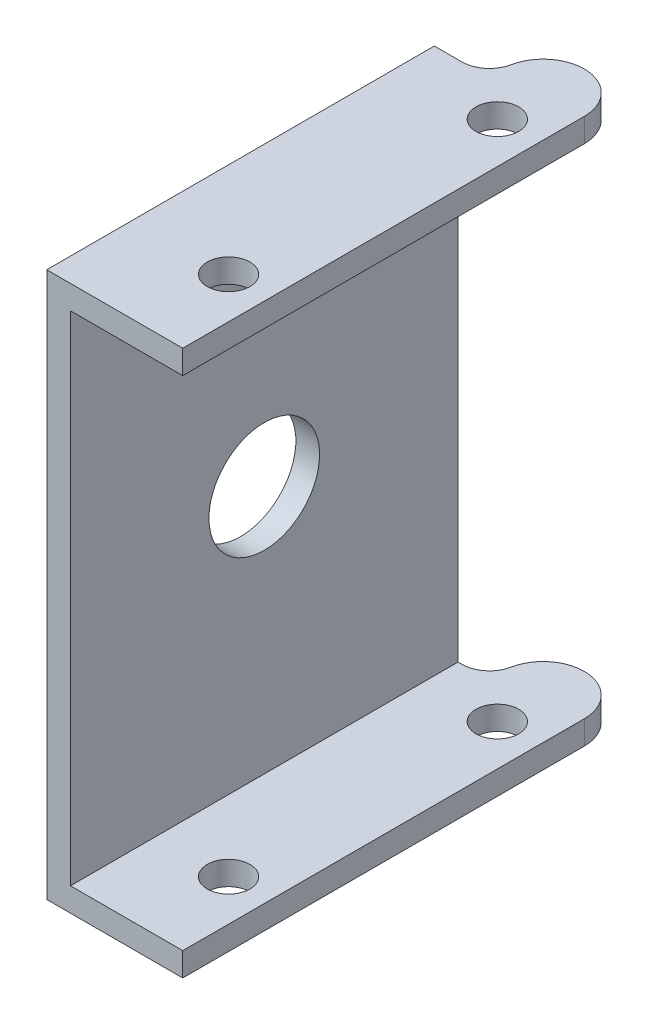
ISO-10303-21;
HEADER;
FILE_DESCRIPTION(('STEP AP214'),'2;1');
FILE_NAME('part.step','',(''),(''),'','','');
FILE_SCHEMA(('AUTOMOTIVE_DESIGN { 1 0 10303 214 1 1 1 1 }'));
ENDSEC;
DATA;
#1=APPLICATION_CONTEXT('core data for automotive mechanical design processes');
#2=APPLICATION_PROTOCOL_DEFINITION('international standard','automotive_design',2000,#1);
#3=PRODUCT_CONTEXT('',#1,'mechanical');
#4=PRODUCT('Part','Part','',(#3));
#5=PRODUCT_RELATED_PRODUCT_CATEGORY('part','',(#4));
#6=PRODUCT_DEFINITION_FORMATION('','',#4);
#7=PRODUCT_DEFINITION_CONTEXT('part definition',#1,'design');
#8=PRODUCT_DEFINITION('design','',#6,#7);
#9=PRODUCT_DEFINITION_SHAPE('','',#8);
#10=(LENGTH_UNIT() NAMED_UNIT(*) SI_UNIT(.MILLI.,.METRE.));
#11=(NAMED_UNIT(*) PLANE_ANGLE_UNIT() SI_UNIT($,.RADIAN.));
#12=(NAMED_UNIT(*) SI_UNIT($,.STERADIAN.) SOLID_ANGLE_UNIT());
#13=UNCERTAINTY_MEASURE_WITH_UNIT(LENGTH_MEASURE(1.E-05),#10,'distance_accuracy_value','');
#14=(GEOMETRIC_REPRESENTATION_CONTEXT(3) GLOBAL_UNCERTAINTY_ASSIGNED_CONTEXT((#13)) GLOBAL_UNIT_ASSIGNED_CONTEXT((#10,
#11,#12)) REPRESENTATION_CONTEXT('',''));
#15=CARTESIAN_POINT('',(0.,0.,0.));
#16=DIRECTION('',(0.,0.,1.));
#17=DIRECTION('',(1.,0.,0.));
#18=AXIS2_PLACEMENT_3D('',#15,#16,#17);
#19=CARTESIAN_POINT('',(8.6,0.,14.));
#20=DIRECTION('',(0.,1.,0.));
#21=DIRECTION('',(-1.,0.,0.));
#22=AXIS2_PLACEMENT_3D('',#19,#20,#21);
#23=PLANE('',#22);
#24=CARTESIAN_POINT('',(6.,0.,8.5));
#25=DIRECTION('',(0.,1.,0.));
#26=DIRECTION('',(-1.,0.,0.));
#27=AXIS2_PLACEMENT_3D('',#24,#25,#26);
#28=CIRCLE('',#27,1.35);
#29=CARTESIAN_POINT('',(4.65,0.,8.5));
#30=VERTEX_POINT('',#29);
#31=EDGE_CURVE('E162',#30,#30,#28,.T.);
#32=ORIENTED_EDGE('',*,*,#31,.T.);
#33=EDGE_LOOP('',(#32));
#34=FACE_BOUND('',#33,.T.);
#35=CARTESIAN_POINT('',(6.,0.,-8.5));
#36=DIRECTION('',(0.,1.,0.));
#37=DIRECTION('',(-1.,0.,0.));
#38=AXIS2_PLACEMENT_3D('',#35,#36,#37);
#39=CIRCLE('',#38,1.35);
#40=CARTESIAN_POINT('',(4.65,0.,-8.5));
#41=VERTEX_POINT('',#40);
#42=EDGE_CURVE('E174',#41,#41,#39,.T.);
#43=ORIENTED_EDGE('',*,*,#42,.T.);
#44=EDGE_LOOP('',(#43));
#45=FACE_BOUND('',#44,.T.);
#46=CARTESIAN_POINT('',(6.,0.,-11.4));
#47=DIRECTION('',(0.,1.,0.));
#48=DIRECTION('',(0.,0.,1.));
#49=AXIS2_PLACEMENT_3D('',#46,#47,#48);
#50=CIRCLE('',#49,2.6);
#51=CARTESIAN_POINT('',(8.6,0.,-11.4));
#52=VERTEX_POINT('',#51);
#53=CARTESIAN_POINT('',(3.4511622832782,0.,-11.9132507124364));
#54=VERTEX_POINT('',#53);
#55=EDGE_CURVE('E121',#52,#54,#50,.T.);
#56=ORIENTED_EDGE('',*,*,#55,.F.);
#57=DIRECTION('',(0.,0.,-1.));
#58=VECTOR('',#57,1.);
#59=CARTESIAN_POINT('',(8.6,0.,14.));
#60=LINE('',#59,#58);
#61=CARTESIAN_POINT('',(8.6,0.,14.));
#62=VERTEX_POINT('',#61);
#63=EDGE_CURVE('E11',#62,#52,#60,.T.);
#64=ORIENTED_EDGE('',*,*,#63,.F.);
#65=DIRECTION('',(1.,0.,0.));
#66=VECTOR('',#65,1.);
#67=CARTESIAN_POINT('',(8.6,0.,14.));
#68=LINE('',#67,#66);
#69=CARTESIAN_POINT('',(0.,0.,14.));
#70=VERTEX_POINT('',#69);
#71=EDGE_CURVE('E185',#70,#62,#68,.T.);
#72=ORIENTED_EDGE('',*,*,#71,.F.);
#73=DIRECTION('',(0.,0.,-1.));
#74=VECTOR('',#73,1.);
#75=CARTESIAN_POINT('',(0.,0.,14.));
#76=LINE('',#75,#74);
#77=CARTESIAN_POINT('',(0.,0.,-10.514544668059));
#78=VERTEX_POINT('',#77);
#79=EDGE_CURVE('E125',#70,#78,#76,.T.);
#80=ORIENTED_EDGE('',*,*,#79,.T.);
#81=DIRECTION('',(-1.,0.,0.));
#82=VECTOR('',#81,1.);
#83=CARTESIAN_POINT('',(0.,0.,-10.514544668059));
#84=LINE('',#83,#82);
#85=CARTESIAN_POINT('',(1.74272766597048,0.,-10.514544668059));
#86=VERTEX_POINT('',#85);
#87=EDGE_CURVE('E30',#86,#78,#84,.T.);
#88=ORIENTED_EDGE('',*,*,#87,.F.);
#89=CARTESIAN_POINT('',(1.74272766597048,0.,-12.2572723340295));
#90=DIRECTION('',(0.,1.,0.));
#91=DIRECTION('',(0.,0.,1.));
#92=AXIS2_PLACEMENT_3D('',#89,#90,#91);
#93=CIRCLE('',#92,1.74272766597049);
#94=EDGE_CURVE('E115',#86,#54,#93,.T.);
#95=ORIENTED_EDGE('',*,*,#94,.T.);
#96=EDGE_LOOP('',(#56,#64,#72,#80,#88,#95));
#97=FACE_BOUND('',#96,.T.);
#98=ADVANCED_FACE('F16',(#34,#45,#97),#23,.F.);
#99=CARTESIAN_POINT('',(1.5,1.5,14.));
#100=DIRECTION('',(0.,-1.,0.));
#101=DIRECTION('',(0.,0.,-1.));
#102=AXIS2_PLACEMENT_3D('',#99,#100,#101);
#103=PLANE('',#102);
#104=CARTESIAN_POINT('',(6.,1.5,8.5));
#105=DIRECTION('',(0.,-1.,0.));
#106=DIRECTION('',(0.,0.,-1.));
#107=AXIS2_PLACEMENT_3D('',#104,#105,#106);
#108=CIRCLE('',#107,1.35);
#109=CARTESIAN_POINT('',(6.,1.5,7.15));
#110=VERTEX_POINT('',#109);
#111=EDGE_CURVE('E170',#110,#110,#108,.T.);
#112=ORIENTED_EDGE('',*,*,#111,.T.);
#113=EDGE_LOOP('',(#112));
#114=FACE_BOUND('',#113,.T.);
#115=CARTESIAN_POINT('',(6.,1.5,-8.5));
#116=DIRECTION('',(0.,-1.,0.));
#117=DIRECTION('',(0.,0.,-1.));
#118=AXIS2_PLACEMENT_3D('',#115,#116,#117);
#119=CIRCLE('',#118,1.35);
#120=CARTESIAN_POINT('',(6.,1.5,-9.85));
#121=VERTEX_POINT('',#120);
#122=EDGE_CURVE('E182',#121,#121,#119,.T.);
#123=ORIENTED_EDGE('',*,*,#122,.T.);
#124=EDGE_LOOP('',(#123));
#125=FACE_BOUND('',#124,.T.);
#126=DIRECTION('',(0.,0.,-1.));
#127=VECTOR('',#126,1.);
#128=CARTESIAN_POINT('',(8.6,1.5,14.));
#129=LINE('',#128,#127);
#130=CARTESIAN_POINT('',(8.6,1.5,14.));
#131=VERTEX_POINT('',#130);
#132=CARTESIAN_POINT('',(8.6,1.5,-11.4));
#133=VERTEX_POINT('',#132);
#134=EDGE_CURVE('E23',#131,#133,#129,.T.);
#135=ORIENTED_EDGE('',*,*,#134,.T.);
#136=CARTESIAN_POINT('',(6.,1.5,-11.4));
#137=DIRECTION('',(0.,-1.,0.));
#138=DIRECTION('',(0.,0.,-1.));
#139=AXIS2_PLACEMENT_3D('',#136,#137,#138);
#140=CIRCLE('',#139,2.6);
#141=CARTESIAN_POINT('',(3.4511622832782,1.5,-11.9132507124364));
#142=VERTEX_POINT('',#141);
#143=EDGE_CURVE('E144',#142,#133,#140,.T.);
#144=ORIENTED_EDGE('',*,*,#143,.F.);
#145=CARTESIAN_POINT('',(1.74272766597048,1.5,-12.2572723340295));
#146=DIRECTION('',(0.,-1.,0.));
#147=DIRECTION('',(0.,0.,-1.));
#148=AXIS2_PLACEMENT_3D('',#145,#146,#147);
#149=CIRCLE('',#148,1.74272766597049);
#150=CARTESIAN_POINT('',(1.74272766597048,1.5,-10.514544668059));
#151=VERTEX_POINT('',#150);
#152=EDGE_CURVE('E159',#142,#151,#149,.T.);
#153=ORIENTED_EDGE('',*,*,#152,.T.);
#154=DIRECTION('',(1.,0.,0.));
#155=VECTOR('',#154,1.);
#156=CARTESIAN_POINT('',(1.5,1.5,-10.514544668059));
#157=LINE('',#156,#155);
#158=CARTESIAN_POINT('',(1.5,1.5,-10.514544668059));
#159=VERTEX_POINT('',#158);
#160=EDGE_CURVE('E107',#159,#151,#157,.T.);
#161=ORIENTED_EDGE('',*,*,#160,.F.);
#162=DIRECTION('',(0.,0.,-1.));
#163=VECTOR('',#162,1.);
#164=CARTESIAN_POINT('',(1.5,1.5,14.));
#165=LINE('',#164,#163);
#166=CARTESIAN_POINT('',(1.5,1.5,14.));
#167=VERTEX_POINT('',#166);
#168=EDGE_CURVE('E213',#167,#159,#165,.T.);
#169=ORIENTED_EDGE('',*,*,#168,.F.);
#170=DIRECTION('',(-1.,0.,0.));
#171=VECTOR('',#170,1.);
#172=CARTESIAN_POINT('',(1.5,1.5,14.));
#173=LINE('',#172,#171);
#174=EDGE_CURVE('E189',#131,#167,#173,.T.);
#175=ORIENTED_EDGE('',*,*,#174,.F.);
#176=EDGE_LOOP('',(#135,#144,#153,#161,#169,#175));
#177=FACE_BOUND('',#176,.T.);
#178=ADVANCED_FACE('F220',(#114,#125,#177),#103,.F.);
#179=CARTESIAN_POINT('',(1.5,33.,14.));
#180=DIRECTION('',(-1.,0.,0.));
#181=DIRECTION('',(0.,-1.,0.));
#182=AXIS2_PLACEMENT_3D('',#179,#180,#181);
#183=PLANE('',#182);
#184=CARTESIAN_POINT('',(1.5,17.25,1.74272766597048));
#185=DIRECTION('',(-1.,0.,0.));
#186=DIRECTION('',(0.,-1.,0.));
#187=AXIS2_PLACEMENT_3D('',#184,#185,#186);
#188=CIRCLE('',#187,3.5);
#189=CARTESIAN_POINT('',(1.5,13.75,1.74272766597048));
#190=VERTEX_POINT('',#189);
#191=EDGE_CURVE('E131',#190,#190,#188,.T.);
#192=ORIENTED_EDGE('',*,*,#191,.T.);
#193=EDGE_LOOP('',(#192));
#194=FACE_BOUND('',#193,.T.);
#195=DIRECTION('',(0.,-1.,0.));
#196=VECTOR('',#195,1.);
#197=CARTESIAN_POINT('',(1.5,33.,-10.514544668059));
#198=LINE('',#197,#196);
#199=CARTESIAN_POINT('',(1.5,33.,-10.514544668059));
#200=VERTEX_POINT('',#199);
#201=EDGE_CURVE('E153',#200,#159,#198,.T.);
#202=ORIENTED_EDGE('',*,*,#201,.F.);
#203=DIRECTION('',(0.,0.,-1.));
#204=VECTOR('',#203,1.);
#205=CARTESIAN_POINT('',(1.5,33.,14.));
#206=LINE('',#205,#204);
#207=CARTESIAN_POINT('',(1.5,33.,14.));
#208=VERTEX_POINT('',#207);
#209=EDGE_CURVE('E210',#208,#200,#206,.T.);
#210=ORIENTED_EDGE('',*,*,#209,.F.);
#211=DIRECTION('',(0.,1.,0.));
#212=VECTOR('',#211,1.);
#213=CARTESIAN_POINT('',(1.5,33.,14.));
#214=LINE('',#213,#212);
#215=EDGE_CURVE('E191',#167,#208,#214,.T.);
#216=ORIENTED_EDGE('',*,*,#215,.F.);
#217=ORIENTED_EDGE('',*,*,#168,.T.);
#218=EDGE_LOOP('',(#202,#210,#216,#217));
#219=FACE_BOUND('',#218,.T.);
#220=ADVANCED_FACE('F232',(#194,#219),#183,.F.);
#221=CARTESIAN_POINT('',(8.6,33.,14.));
#222=DIRECTION('',(0.,1.,0.));
#223=DIRECTION('',(0.,0.,1.));
#224=AXIS2_PLACEMENT_3D('',#221,#222,#223);
#225=PLANE('',#224);
#226=CARTESIAN_POINT('',(6.,33.,8.5));
#227=DIRECTION('',(0.,1.,0.));
#228=DIRECTION('',(0.,0.,1.));
#229=AXIS2_PLACEMENT_3D('',#226,#227,#228);
#230=CIRCLE('',#229,1.35);
#231=CARTESIAN_POINT('',(6.,33.,9.85));
#232=VERTEX_POINT('',#231);
#233=EDGE_CURVE('E165',#232,#232,#230,.T.);
#234=ORIENTED_EDGE('',*,*,#233,.T.);
#235=EDGE_LOOP('',(#234));
#236=FACE_BOUND('',#235,.T.);
#237=CARTESIAN_POINT('',(6.,33.,-8.5));
#238=DIRECTION('',(0.,1.,0.));
#239=DIRECTION('',(0.,0.,1.));
#240=AXIS2_PLACEMENT_3D('',#237,#238,#239);
#241=CIRCLE('',#240,1.35);
#242=CARTESIAN_POINT('',(6.,33.,-7.15));
#243=VERTEX_POINT('',#242);
#244=EDGE_CURVE('E177',#243,#243,#241,.T.);
#245=ORIENTED_EDGE('',*,*,#244,.T.);
#246=EDGE_LOOP('',(#245));
#247=FACE_BOUND('',#246,.T.);
#248=CARTESIAN_POINT('',(6.,33.,-11.4));
#249=DIRECTION('',(0.,1.,0.));
#250=DIRECTION('',(0.,0.,1.));
#251=AXIS2_PLACEMENT_3D('',#248,#249,#250);
#252=CIRCLE('',#251,2.6);
#253=CARTESIAN_POINT('',(8.6,33.,-11.4));
#254=VERTEX_POINT('',#253);
#255=CARTESIAN_POINT('',(3.4511622832782,33.,-11.9132507124364));
#256=VERTEX_POINT('',#255);
#257=EDGE_CURVE('E148',#254,#256,#252,.T.);
#258=ORIENTED_EDGE('',*,*,#257,.F.);
#259=DIRECTION('',(0.,0.,-1.));
#260=VECTOR('',#259,1.);
#261=CARTESIAN_POINT('',(8.6,33.,14.));
#262=LINE('',#261,#260);
#263=CARTESIAN_POINT('',(8.6,33.,14.));
#264=VERTEX_POINT('',#263);
#265=EDGE_CURVE('E207',#264,#254,#262,.T.);
#266=ORIENTED_EDGE('',*,*,#265,.F.);
#267=DIRECTION('',(1.,0.,0.));
#268=VECTOR('',#267,1.);
#269=CARTESIAN_POINT('',(8.6,33.,14.));
#270=LINE('',#269,#268);
#271=EDGE_CURVE('E193',#208,#264,#270,.T.);
#272=ORIENTED_EDGE('',*,*,#271,.F.);
#273=ORIENTED_EDGE('',*,*,#209,.T.);
#274=DIRECTION('',(-1.,0.,0.));
#275=VECTOR('',#274,1.);
#276=CARTESIAN_POINT('',(8.6,33.,-10.514544668059));
#277=LINE('',#276,#275);
#278=CARTESIAN_POINT('',(1.74272766597048,33.,-10.514544668059));
#279=VERTEX_POINT('',#278);
#280=EDGE_CURVE('E150',#279,#200,#277,.T.);
#281=ORIENTED_EDGE('',*,*,#280,.F.);
#282=CARTESIAN_POINT('',(1.74272766597048,33.,-12.2572723340295));
#283=DIRECTION('',(0.,1.,0.));
#284=DIRECTION('',(0.,0.,1.));
#285=AXIS2_PLACEMENT_3D('',#282,#283,#284);
#286=CIRCLE('',#285,1.74272766597049);
#287=EDGE_CURVE('E156',#279,#256,#286,.T.);
#288=ORIENTED_EDGE('',*,*,#287,.T.);
#289=EDGE_LOOP('',(#258,#266,#272,#273,#281,#288));
#290=FACE_BOUND('',#289,.T.);
#291=ADVANCED_FACE('F238',(#236,#247,#290),#225,.F.);
#292=CARTESIAN_POINT('',(0.,34.5,14.));
#293=DIRECTION('',(0.,-1.,0.));
#294=DIRECTION('',(0.,0.,-1.));
#295=AXIS2_PLACEMENT_3D('',#292,#293,#294);
#296=PLANE('',#295);
#297=CARTESIAN_POINT('',(6.,34.5,8.5));
#298=DIRECTION('',(0.,1.,0.));
#299=DIRECTION('',(-1.,0.,0.));
#300=AXIS2_PLACEMENT_3D('',#297,#298,#299);
#301=CIRCLE('',#300,1.35);
#302=CARTESIAN_POINT('',(4.65,34.5,8.5));
#303=VERTEX_POINT('',#302);
#304=EDGE_CURVE('E161',#303,#303,#301,.T.);
#305=ORIENTED_EDGE('',*,*,#304,.F.);
#306=EDGE_LOOP('',(#305));
#307=FACE_BOUND('',#306,.T.);
#308=CARTESIAN_POINT('',(6.,34.5,-8.5));
#309=DIRECTION('',(0.,1.,0.));
#310=DIRECTION('',(-1.,0.,0.));
#311=AXIS2_PLACEMENT_3D('',#308,#309,#310);
#312=CIRCLE('',#311,1.35);
#313=CARTESIAN_POINT('',(4.65,34.5,-8.5));
#314=VERTEX_POINT('',#313);
#315=EDGE_CURVE('E173',#314,#314,#312,.T.);
#316=ORIENTED_EDGE('',*,*,#315,.F.);
#317=EDGE_LOOP('',(#316));
#318=FACE_BOUND('',#317,.T.);
#319=CARTESIAN_POINT('',(6.,34.5,-11.4));
#320=DIRECTION('',(0.,1.,0.));
#321=DIRECTION('',(0.,0.,1.));
#322=AXIS2_PLACEMENT_3D('',#319,#320,#321);
#323=CIRCLE('',#322,2.6);
#324=CARTESIAN_POINT('',(8.6,34.5,-11.4));
#325=VERTEX_POINT('',#324);
#326=CARTESIAN_POINT('',(3.4511622832782,34.5,-11.9132507124364));
#327=VERTEX_POINT('',#326);
#328=EDGE_CURVE('E126',#325,#327,#323,.T.);
#329=ORIENTED_EDGE('',*,*,#328,.T.);
#330=CARTESIAN_POINT('',(1.74272766597048,34.5,-12.2572723340295));
#331=DIRECTION('',(0.,1.,0.));
#332=DIRECTION('',(0.,0.,1.));
#333=AXIS2_PLACEMENT_3D('',#330,#331,#332);
#334=CIRCLE('',#333,1.74272766597049);
#335=CARTESIAN_POINT('',(1.74272766597048,34.5,-10.514544668059));
#336=VERTEX_POINT('',#335);
#337=EDGE_CURVE('E128',#336,#327,#334,.T.);
#338=ORIENTED_EDGE('',*,*,#337,.F.);
#339=DIRECTION('',(-1.,0.,0.));
#340=VECTOR('',#339,1.);
#341=CARTESIAN_POINT('',(0.,34.5,-10.514544668059));
#342=LINE('',#341,#340);
#343=CARTESIAN_POINT('',(0.,34.5,-10.514544668059));
#344=VERTEX_POINT('',#343);
#345=EDGE_CURVE('E136',#336,#344,#342,.T.);
#346=ORIENTED_EDGE('',*,*,#345,.T.);
#347=DIRECTION('',(0.,0.,-1.));
#348=VECTOR('',#347,1.);
#349=CARTESIAN_POINT('',(0.,34.5,14.));
#350=LINE('',#349,#348);
#351=CARTESIAN_POINT('',(0.,34.5,14.));
#352=VERTEX_POINT('',#351);
#353=EDGE_CURVE('E201',#352,#344,#350,.T.);
#354=ORIENTED_EDGE('',*,*,#353,.F.);
#355=DIRECTION('',(-1.,0.,0.));
#356=VECTOR('',#355,1.);
#357=CARTESIAN_POINT('',(0.,34.5,14.));
#358=LINE('',#357,#356);
#359=CARTESIAN_POINT('',(8.6,34.5,14.));
#360=VERTEX_POINT('',#359);
#361=EDGE_CURVE('E197',#360,#352,#358,.T.);
#362=ORIENTED_EDGE('',*,*,#361,.F.);
#363=DIRECTION('',(0.,0.,-1.));
#364=VECTOR('',#363,1.);
#365=CARTESIAN_POINT('',(8.6,34.5,14.));
#366=LINE('',#365,#364);
#367=EDGE_CURVE('E204',#360,#325,#366,.T.);
#368=ORIENTED_EDGE('',*,*,#367,.T.);
#369=EDGE_LOOP('',(#329,#338,#346,#354,#362,#368));
#370=FACE_BOUND('',#369,.T.);
#371=ADVANCED_FACE('F247',(#307,#318,#370),#296,.F.);
#372=CARTESIAN_POINT('',(0.,0.,14.));
#373=DIRECTION('',(1.,0.,0.));
#374=DIRECTION('',(0.,0.,-1.));
#375=AXIS2_PLACEMENT_3D('',#372,#373,#374);
#376=PLANE('',#375);
#377=CARTESIAN_POINT('',(0.,17.25,1.74272766597048));
#378=DIRECTION('',(-1.,0.,0.));
#379=DIRECTION('',(0.,0.,1.));
#380=AXIS2_PLACEMENT_3D('',#377,#378,#379);
#381=CIRCLE('',#380,3.5);
#382=CARTESIAN_POINT('',(0.,17.25,5.24272766597048));
#383=VERTEX_POINT('',#382);
#384=EDGE_CURVE('E440',#383,#383,#381,.T.);
#385=ORIENTED_EDGE('',*,*,#384,.F.);
#386=EDGE_LOOP('',(#385));
#387=FACE_BOUND('',#386,.T.);
#388=DIRECTION('',(0.,1.,0.));
#389=VECTOR('',#388,1.);
#390=CARTESIAN_POINT('',(0.,0.,-10.514544668059));
#391=LINE('',#390,#389);
#392=EDGE_CURVE('E135',#78,#344,#391,.T.);
#393=ORIENTED_EDGE('',*,*,#392,.F.);
#394=ORIENTED_EDGE('',*,*,#79,.F.);
#395=DIRECTION('',(0.,-1.,0.));
#396=VECTOR('',#395,1.);
#397=CARTESIAN_POINT('',(0.,0.,14.));
#398=LINE('',#397,#396);
#399=EDGE_CURVE('E38',#352,#70,#398,.T.);
#400=ORIENTED_EDGE('',*,*,#399,.F.);
#401=ORIENTED_EDGE('',*,*,#353,.T.);
#402=EDGE_LOOP('',(#393,#394,#400,#401));
#403=FACE_BOUND('',#402,.T.);
#404=ADVANCED_FACE('F251',(#387,#403),#376,.F.);
#405=CARTESIAN_POINT('',(8.6,1.5,14.));
#406=DIRECTION('',(-1.,0.,0.));
#407=DIRECTION('',(0.,0.,1.));
#408=AXIS2_PLACEMENT_3D('',#405,#406,#407);
#409=PLANE('',#408);
#410=ORIENTED_EDGE('',*,*,#63,.T.);
#411=DIRECTION('',(0.,1.,0.));
#412=VECTOR('',#411,1.);
#413=CARTESIAN_POINT('',(8.6,0.,-11.4));
#414=LINE('',#413,#412);
#415=EDGE_CURVE('E141',#52,#133,#414,.T.);
#416=ORIENTED_EDGE('',*,*,#415,.T.);
#417=ORIENTED_EDGE('',*,*,#134,.F.);
#418=DIRECTION('',(0.,1.,0.));
#419=VECTOR('',#418,1.);
#420=CARTESIAN_POINT('',(8.6,1.5,14.));
#421=LINE('',#420,#419);
#422=EDGE_CURVE('E187',#62,#131,#421,.T.);
#423=ORIENTED_EDGE('',*,*,#422,.F.);
#424=EDGE_LOOP('',(#410,#416,#417,#423));
#425=FACE_BOUND('',#424,.T.);
#426=ADVANCED_FACE('F223',(#425),#409,.F.);
#427=CARTESIAN_POINT('',(8.6,34.5,14.));
#428=DIRECTION('',(-1.,0.,0.));
#429=DIRECTION('',(0.,-1.,0.));
#430=AXIS2_PLACEMENT_3D('',#427,#428,#429);
#431=PLANE('',#430);
#432=ORIENTED_EDGE('',*,*,#265,.T.);
#433=EDGE_CURVE('E145',#254,#325,#414,.T.);
#434=ORIENTED_EDGE('',*,*,#433,.T.);
#435=ORIENTED_EDGE('',*,*,#367,.F.);
#436=DIRECTION('',(0.,1.,0.));
#437=VECTOR('',#436,1.);
#438=CARTESIAN_POINT('',(8.6,34.5,14.));
#439=LINE('',#438,#437);
#440=EDGE_CURVE('E195',#264,#360,#439,.T.);
#441=ORIENTED_EDGE('',*,*,#440,.F.);
#442=EDGE_LOOP('',(#432,#434,#435,#441));
#443=FACE_BOUND('',#442,.T.);
#444=ADVANCED_FACE('F245',(#443),#431,.F.);
#445=CARTESIAN_POINT('',(0.,0.,14.));
#446=DIRECTION('',(0.,0.,-1.));
#447=DIRECTION('',(-1.,0.,0.));
#448=AXIS2_PLACEMENT_3D('',#445,#446,#447);
#449=PLANE('',#448);
#450=ORIENTED_EDGE('',*,*,#71,.T.);
#451=ORIENTED_EDGE('',*,*,#422,.T.);
#452=ORIENTED_EDGE('',*,*,#174,.T.);
#453=ORIENTED_EDGE('',*,*,#215,.T.);
#454=ORIENTED_EDGE('',*,*,#271,.T.);
#455=ORIENTED_EDGE('',*,*,#440,.T.);
#456=ORIENTED_EDGE('',*,*,#361,.T.);
#457=ORIENTED_EDGE('',*,*,#399,.T.);
#458=EDGE_LOOP('',(#450,#451,#452,#453,#454,#455,#456,#457));
#459=FACE_BOUND('',#458,.T.);
#460=ADVANCED_FACE('F227',(#459),#449,.F.);
#461=CARTESIAN_POINT('',(6.,0.,-8.5));
#462=DIRECTION('',(0.,1.,0.));
#463=DIRECTION('',(-1.,0.,0.));
#464=AXIS2_PLACEMENT_3D('',#461,#462,#463);
#465=CYLINDRICAL_SURFACE('',#464,1.35);
#466=ORIENTED_EDGE('',*,*,#315,.T.);
#467=EDGE_LOOP('',(#466));
#468=FACE_BOUND('',#467,.T.);
#469=ORIENTED_EDGE('',*,*,#244,.F.);
#470=EDGE_LOOP('',(#469));
#471=FACE_BOUND('',#470,.T.);
#472=ADVANCED_FACE('F287',(#468,#471),#465,.F.);
#473=ORIENTED_EDGE('',*,*,#42,.F.);
#474=EDGE_LOOP('',(#473));
#475=FACE_BOUND('',#474,.T.);
#476=ORIENTED_EDGE('',*,*,#122,.F.);
#477=EDGE_LOOP('',(#476));
#478=FACE_BOUND('',#477,.T.);
#479=ADVANCED_FACE('F283',(#475,#478),#465,.F.);
#480=CARTESIAN_POINT('',(6.,0.,8.5));
#481=DIRECTION('',(0.,1.,0.));
#482=DIRECTION('',(-1.,0.,0.));
#483=AXIS2_PLACEMENT_3D('',#480,#481,#482);
#484=CYLINDRICAL_SURFACE('',#483,1.35);
#485=ORIENTED_EDGE('',*,*,#304,.T.);
#486=EDGE_LOOP('',(#485));
#487=FACE_BOUND('',#486,.T.);
#488=ORIENTED_EDGE('',*,*,#233,.F.);
#489=EDGE_LOOP('',(#488));
#490=FACE_BOUND('',#489,.T.);
#491=ADVANCED_FACE('F286',(#487,#490),#484,.F.);
#492=ORIENTED_EDGE('',*,*,#31,.F.);
#493=EDGE_LOOP('',(#492));
#494=FACE_BOUND('',#493,.T.);
#495=ORIENTED_EDGE('',*,*,#111,.F.);
#496=EDGE_LOOP('',(#495));
#497=FACE_BOUND('',#496,.T.);
#498=ADVANCED_FACE('F296',(#494,#497),#484,.F.);
#499=CARTESIAN_POINT('',(1.74272766597048,0.,-12.2572723340295));
#500=DIRECTION('',(0.,1.,0.));
#501=DIRECTION('',(0.,0.,1.));
#502=AXIS2_PLACEMENT_3D('',#499,#500,#501);
#503=CYLINDRICAL_SURFACE('',#502,1.74272766597049);
#504=DIRECTION('',(0.,1.,0.));
#505=VECTOR('',#504,1.);
#506=CARTESIAN_POINT('',(3.4511622832782,0.,-11.9132507124364));
#507=LINE('',#506,#505);
#508=EDGE_CURVE('E118',#54,#142,#507,.T.);
#509=ORIENTED_EDGE('',*,*,#508,.F.);
#510=ORIENTED_EDGE('',*,*,#94,.F.);
#511=DIRECTION('',(0.,1.,0.));
#512=VECTOR('',#511,1.);
#513=CARTESIAN_POINT('',(1.74272766597048,0.,-10.514544668059));
#514=LINE('',#513,#512);
#515=EDGE_CURVE('E103',#86,#151,#514,.T.);
#516=ORIENTED_EDGE('',*,*,#515,.T.);
#517=ORIENTED_EDGE('',*,*,#152,.F.);
#518=EDGE_LOOP('',(#509,#510,#516,#517));
#519=FACE_BOUND('',#518,.T.);
#520=ADVANCED_FACE('F116',(#519),#503,.F.);
#521=EDGE_CURVE('E111',#279,#336,#514,.T.);
#522=ORIENTED_EDGE('',*,*,#521,.T.);
#523=ORIENTED_EDGE('',*,*,#337,.T.);
#524=EDGE_CURVE('E110',#256,#327,#507,.T.);
#525=ORIENTED_EDGE('',*,*,#524,.F.);
#526=ORIENTED_EDGE('',*,*,#287,.F.);
#527=EDGE_LOOP('',(#522,#523,#525,#526));
#528=FACE_BOUND('',#527,.T.);
#529=ADVANCED_FACE('F256',(#528),#503,.F.);
#530=CARTESIAN_POINT('',(0.,0.,-10.514544668059));
#531=DIRECTION('',(0.,0.,-1.));
#532=DIRECTION('',(-1.,0.,0.));
#533=AXIS2_PLACEMENT_3D('',#530,#531,#532);
#534=PLANE('',#533);
#535=ORIENTED_EDGE('',*,*,#160,.T.);
#536=ORIENTED_EDGE('',*,*,#515,.F.);
#537=ORIENTED_EDGE('',*,*,#87,.T.);
#538=ORIENTED_EDGE('',*,*,#392,.T.);
#539=ORIENTED_EDGE('',*,*,#345,.F.);
#540=ORIENTED_EDGE('',*,*,#521,.F.);
#541=ORIENTED_EDGE('',*,*,#280,.T.);
#542=ORIENTED_EDGE('',*,*,#201,.T.);
#543=EDGE_LOOP('',(#535,#536,#537,#538,#539,#540,#541,#542));
#544=FACE_BOUND('',#543,.T.);
#545=ADVANCED_FACE('F105',(#544),#534,.T.);
#546=CARTESIAN_POINT('',(6.,0.,-11.4));
#547=DIRECTION('',(0.,1.,0.));
#548=DIRECTION('',(0.,0.,1.));
#549=AXIS2_PLACEMENT_3D('',#546,#547,#548);
#550=CYLINDRICAL_SURFACE('',#549,2.6);
#551=ORIENTED_EDGE('',*,*,#143,.T.);
#552=ORIENTED_EDGE('',*,*,#415,.F.);
#553=ORIENTED_EDGE('',*,*,#55,.T.);
#554=ORIENTED_EDGE('',*,*,#508,.T.);
#555=EDGE_LOOP('',(#551,#552,#553,#554));
#556=FACE_BOUND('',#555,.T.);
#557=ADVANCED_FACE('F226',(#556),#550,.T.);
#558=ORIENTED_EDGE('',*,*,#257,.T.);
#559=ORIENTED_EDGE('',*,*,#524,.T.);
#560=ORIENTED_EDGE('',*,*,#328,.F.);
#561=ORIENTED_EDGE('',*,*,#433,.F.);
#562=EDGE_LOOP('',(#558,#559,#560,#561));
#563=FACE_BOUND('',#562,.T.);
#564=ADVANCED_FACE('F258',(#563),#550,.T.);
#565=CARTESIAN_POINT('',(8.6,17.25,1.74272766597048));
#566=DIRECTION('',(-1.,0.,0.));
#567=DIRECTION('',(0.,0.,1.));
#568=AXIS2_PLACEMENT_3D('',#565,#566,#567);
#569=CYLINDRICAL_SURFACE('',#568,3.5);
#570=ORIENTED_EDGE('',*,*,#384,.T.);
#571=EDGE_LOOP('',(#570));
#572=FACE_BOUND('',#571,.T.);
#573=ORIENTED_EDGE('',*,*,#191,.F.);
#574=EDGE_LOOP('',(#573));
#575=FACE_BOUND('',#574,.T.);
#576=ADVANCED_FACE('F260',(#572,#575),#569,.F.);
#577=CLOSED_SHELL('',(#98,#178,#220,#291,#371,#404,#426,#444,#460,#472,#479,#491,#498,#520,#529,
#545,#557,#564,#576));
#578=MANIFOLD_SOLID_BREP('B1',#577);
#579=ADVANCED_BREP_SHAPE_REPRESENTATION('',(#18,#578),#14);
#580=SHAPE_DEFINITION_REPRESENTATION(#9,#579);
ENDSEC;
END-ISO-10303-21;
